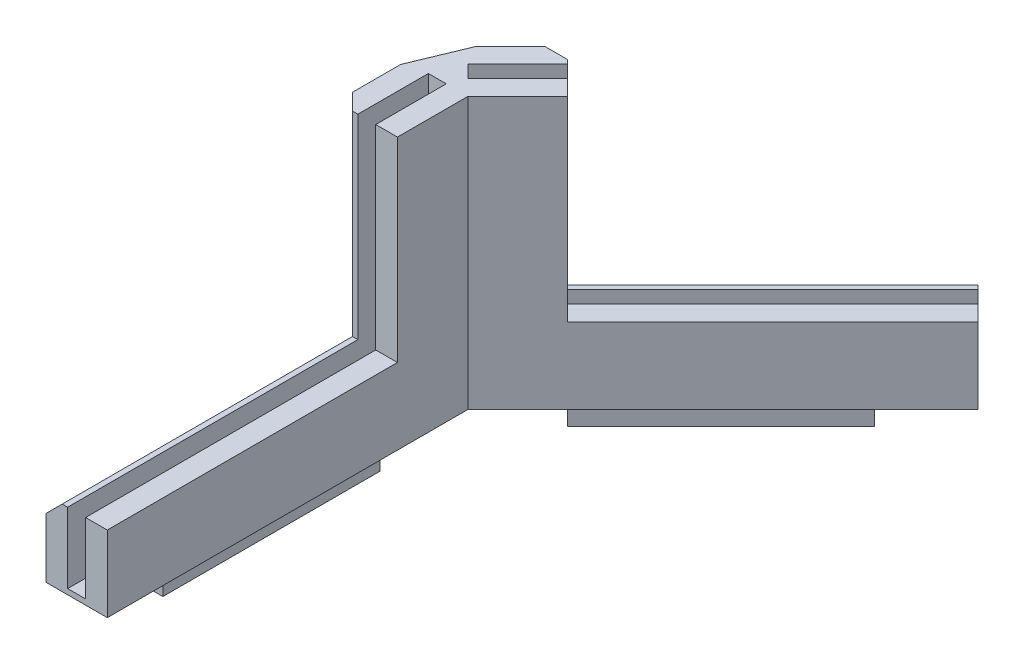
ISO-10303-21;
HEADER;
FILE_DESCRIPTION(('STEP AP214'),'2;1');
FILE_NAME('part.step','',(''),(''),'','','');
FILE_SCHEMA(('AUTOMOTIVE_DESIGN { 1 0 10303 214 1 1 1 1 }'));
ENDSEC;
DATA;
#1=APPLICATION_CONTEXT('core data for automotive mechanical design processes');
#2=APPLICATION_PROTOCOL_DEFINITION('international standard','automotive_design',2000,#1);
#3=PRODUCT_CONTEXT('',#1,'mechanical');
#4=PRODUCT('Part','Part','',(#3));
#5=PRODUCT_RELATED_PRODUCT_CATEGORY('part','',(#4));
#6=PRODUCT_DEFINITION_FORMATION('','',#4);
#7=PRODUCT_DEFINITION_CONTEXT('part definition',#1,'design');
#8=PRODUCT_DEFINITION('design','',#6,#7);
#9=PRODUCT_DEFINITION_SHAPE('','',#8);
#10=(LENGTH_UNIT() NAMED_UNIT(*) SI_UNIT(.MILLI.,.METRE.));
#11=(NAMED_UNIT(*) PLANE_ANGLE_UNIT() SI_UNIT($,.RADIAN.));
#12=(NAMED_UNIT(*) SI_UNIT($,.STERADIAN.) SOLID_ANGLE_UNIT());
#13=UNCERTAINTY_MEASURE_WITH_UNIT(LENGTH_MEASURE(1.E-05),#10,'distance_accuracy_value','');
#14=(GEOMETRIC_REPRESENTATION_CONTEXT(3) GLOBAL_UNCERTAINTY_ASSIGNED_CONTEXT((#13)) GLOBAL_UNIT_ASSIGNED_CONTEXT((#10,
#11,#12)) REPRESENTATION_CONTEXT('',''));
#15=CARTESIAN_POINT('',(0.,0.,0.));
#16=DIRECTION('',(0.,0.,1.));
#17=DIRECTION('',(1.,0.,0.));
#18=AXIS2_PLACEMENT_3D('',#15,#16,#17);
#19=CARTESIAN_POINT('',(-8.89951235406099,50.,-6.78110368347837));
#20=DIRECTION('',(0.923879869163213,0.,0.382682619614433));
#21=DIRECTION('',(0.,1.,0.));
#22=AXIS2_PLACEMENT_3D('',#19,#20,#21);
#23=PLANE('',#22);
#24=DIRECTION('',(0.,1.,0.));
#25=VECTOR('',#24,1.);
#26=CARTESIAN_POINT('',(-8.89951235406099,50.,-6.78110368347837));
#27=LINE('',#26,#25);
#28=CARTESIAN_POINT('',(-8.89951235406099,0.,-6.78110368347837));
#29=VERTEX_POINT('',#28);
#30=CARTESIAN_POINT('',(-8.89951235406099,50.,-6.78110368347837));
#31=VERTEX_POINT('',#30);
#32=EDGE_CURVE('E583',#29,#31,#27,.T.);
#33=ORIENTED_EDGE('',*,*,#32,.F.);
#34=DIRECTION('',(-0.382682619614433,0.,0.923879869163213));
#35=VECTOR('',#34,1.);
#36=CARTESIAN_POINT('',(-9.99369246144623,0.,-4.13951265572129));
#37=LINE('',#36,#35);
#38=CARTESIAN_POINT('',(-13.,0.,3.11837383565332));
#39=VERTEX_POINT('',#38);
#40=EDGE_CURVE('E591',#39,#29,#37,.F.);
#41=ORIENTED_EDGE('',*,*,#40,.F.);
#42=DIRECTION('',(0.,-1.,0.));
#43=VECTOR('',#42,1.);
#44=CARTESIAN_POINT('',(-13.,50.,3.11837383565332));
#45=LINE('',#44,#43);
#46=CARTESIAN_POINT('',(-13.,50.,3.11837383565332));
#47=VERTEX_POINT('',#46);
#48=EDGE_CURVE('E587',#47,#39,#45,.T.);
#49=ORIENTED_EDGE('',*,*,#48,.F.);
#50=DIRECTION('',(0.382682619614433,0.,-0.923879869163213));
#51=VECTOR('',#50,1.);
#52=CARTESIAN_POINT('',(-8.89951235406099,50.,-6.78110368347837));
#53=LINE('',#52,#51);
#54=EDGE_CURVE('E594',#31,#47,#53,.F.);
#55=ORIENTED_EDGE('',*,*,#54,.F.);
#56=EDGE_LOOP('',(#33,#41,#49,#55));
#57=FACE_BOUND('',#56,.T.);
#58=ADVANCED_FACE('F43',(#57),#23,.F.);
#59=CARTESIAN_POINT('',(-1.7,50.,15.));
#60=DIRECTION('',(0.,0.,-1.));
#61=DIRECTION('',(-1.,0.,0.));
#62=AXIS2_PLACEMENT_3D('',#59,#60,#61);
#63=PLANE('',#62);
#64=DIRECTION('',(1.,0.,0.));
#65=VECTOR('',#64,1.);
#66=CARTESIAN_POINT('',(-9.,50.,15.));
#67=LINE('',#66,#65);
#68=CARTESIAN_POINT('',(-9.99999999999999,50.,15.));
#69=VERTEX_POINT('',#68);
#70=CARTESIAN_POINT('',(-9.,50.,15.));
#71=VERTEX_POINT('',#70);
#72=EDGE_CURVE('E540',#69,#71,#67,.T.);
#73=ORIENTED_EDGE('',*,*,#72,.F.);
#74=DIRECTION('',(0.,-1.,0.));
#75=VECTOR('',#74,1.);
#76=CARTESIAN_POINT('',(-9.99999999999999,50.,15.));
#77=LINE('',#76,#75);
#78=CARTESIAN_POINT('',(-9.99999999999999,14.,15.));
#79=VERTEX_POINT('',#78);
#80=EDGE_CURVE('E610',#69,#79,#77,.T.);
#81=ORIENTED_EDGE('',*,*,#80,.T.);
#82=DIRECTION('',(-1.,0.,0.));
#83=VECTOR('',#82,1.);
#84=CARTESIAN_POINT('',(-13.0000000000001,14.,15.));
#85=LINE('',#84,#83);
#86=CARTESIAN_POINT('',(-9.,14.,15.));
#87=VERTEX_POINT('',#86);
#88=EDGE_CURVE('E481',#87,#79,#85,.T.);
#89=ORIENTED_EDGE('',*,*,#88,.F.);
#90=DIRECTION('',(0.,-1.,0.));
#91=VECTOR('',#90,1.);
#92=CARTESIAN_POINT('',(-9.,50.,15.));
#93=LINE('',#92,#91);
#94=EDGE_CURVE('E579',#71,#87,#93,.T.);
#95=ORIENTED_EDGE('',*,*,#94,.F.);
#96=EDGE_LOOP('',(#73,#81,#89,#95));
#97=FACE_BOUND('',#96,.T.);
#98=ADVANCED_FACE('F708',(#97),#63,.F.);
#99=DIRECTION('',(-1.,0.,0.));
#100=VECTOR('',#99,1.);
#101=CARTESIAN_POINT('',(-5.70000000000014,14.,15.));
#102=LINE('',#101,#100);
#103=CARTESIAN_POINT('',(-1.7,14.,15.));
#104=VERTEX_POINT('',#103);
#105=CARTESIAN_POINT('',(-5.70000000000014,14.,15.));
#106=VERTEX_POINT('',#105);
#107=EDGE_CURVE('E476',#104,#106,#102,.T.);
#108=ORIENTED_EDGE('',*,*,#107,.F.);
#109=DIRECTION('',(0.,-1.,0.));
#110=VECTOR('',#109,1.);
#111=CARTESIAN_POINT('',(-1.7,50.,15.));
#112=LINE('',#111,#110);
#113=CARTESIAN_POINT('',(-1.7,50.,15.));
#114=VERTEX_POINT('',#113);
#115=EDGE_CURVE('E559',#114,#104,#112,.T.);
#116=ORIENTED_EDGE('',*,*,#115,.F.);
#117=DIRECTION('',(1.,0.,0.));
#118=VECTOR('',#117,1.);
#119=CARTESIAN_POINT('',(-1.7,50.,15.));
#120=LINE('',#119,#118);
#121=CARTESIAN_POINT('',(-5.7,50.,15.));
#122=VERTEX_POINT('',#121);
#123=EDGE_CURVE('E553',#122,#114,#120,.T.);
#124=ORIENTED_EDGE('',*,*,#123,.F.);
#125=DIRECTION('',(0.,-1.,0.));
#126=VECTOR('',#125,1.);
#127=CARTESIAN_POINT('',(-5.7,50.,15.));
#128=LINE('',#127,#126);
#129=EDGE_CURVE('E568',#122,#106,#128,.T.);
#130=ORIENTED_EDGE('',*,*,#129,.T.);
#131=EDGE_LOOP('',(#108,#116,#124,#130));
#132=FACE_BOUND('',#131,.T.);
#133=ADVANCED_FACE('F747',(#132),#63,.F.);
#134=CARTESIAN_POINT('',(-9.00000000000004,50.,1.99999999999999));
#135=DIRECTION('',(-1.,0.,0.));
#136=DIRECTION('',(0.,0.,1.));
#137=AXIS2_PLACEMENT_3D('',#134,#135,#136);
#138=PLANE('',#137);
#139=DIRECTION('',(0.,0.,-1.));
#140=VECTOR('',#139,1.);
#141=CARTESIAN_POINT('',(-9.00000000000004,1.,15.));
#142=LINE('',#141,#140);
#143=CARTESIAN_POINT('',(-9.,1.,68.5));
#144=VERTEX_POINT('',#143);
#145=CARTESIAN_POINT('',(-9.00000000000004,1.,1.99999999999999));
#146=VERTEX_POINT('',#145);
#147=EDGE_CURVE('E528',#144,#146,#142,.T.);
#148=ORIENTED_EDGE('',*,*,#147,.T.);
#149=DIRECTION('',(0.,-1.,0.));
#150=VECTOR('',#149,1.);
#151=CARTESIAN_POINT('',(-9.00000000000004,50.,1.99999999999999));
#152=LINE('',#151,#150);
#153=CARTESIAN_POINT('',(-9.00000000000004,50.,1.99999999999999));
#154=VERTEX_POINT('',#153);
#155=EDGE_CURVE('E575',#154,#146,#152,.T.);
#156=ORIENTED_EDGE('',*,*,#155,.F.);
#157=DIRECTION('',(0.,0.,-1.));
#158=VECTOR('',#157,1.);
#159=CARTESIAN_POINT('',(-9.00000000000004,50.,1.99999999999999));
#160=LINE('',#159,#158);
#161=EDGE_CURVE('E544',#71,#154,#160,.T.);
#162=ORIENTED_EDGE('',*,*,#161,.F.);
#163=ORIENTED_EDGE('',*,*,#94,.T.);
#164=DIRECTION('',(0.,0.,-1.));
#165=VECTOR('',#164,1.);
#166=CARTESIAN_POINT('',(-9.00000000000013,14.,68.5));
#167=LINE('',#166,#165);
#168=CARTESIAN_POINT('',(-9.00000000000013,14.,68.5));
#169=VERTEX_POINT('',#168);
#170=EDGE_CURVE('E506',#169,#87,#167,.T.);
#171=ORIENTED_EDGE('',*,*,#170,.F.);
#172=DIRECTION('',(0.,1.,0.));
#173=VECTOR('',#172,1.);
#174=CARTESIAN_POINT('',(-9.,1.,68.5));
#175=LINE('',#174,#173);
#176=EDGE_CURVE('E499',#144,#169,#175,.T.);
#177=ORIENTED_EDGE('',*,*,#176,.F.);
#178=EDGE_LOOP('',(#148,#156,#162,#163,#171,#177));
#179=FACE_BOUND('',#178,.T.);
#180=ADVANCED_FACE('F736',(#179),#138,.F.);
#181=CARTESIAN_POINT('',(-5.7,50.,1.99999999999999));
#182=DIRECTION('',(0.,0.,-1.));
#183=DIRECTION('',(-1.,0.,0.));
#184=AXIS2_PLACEMENT_3D('',#181,#182,#183);
#185=PLANE('',#184);
#186=DIRECTION('',(-1.,0.,0.));
#187=VECTOR('',#186,1.);
#188=CARTESIAN_POINT('',(-5.7,1.,1.99999999999998));
#189=LINE('',#188,#187);
#190=CARTESIAN_POINT('',(-5.7,1.,1.99999999999999));
#191=VERTEX_POINT('',#190);
#192=EDGE_CURVE('E524',#191,#146,#189,.T.);
#193=ORIENTED_EDGE('',*,*,#192,.F.);
#194=DIRECTION('',(0.,-1.,0.));
#195=VECTOR('',#194,1.);
#196=CARTESIAN_POINT('',(-5.7,50.,1.99999999999999));
#197=LINE('',#196,#195);
#198=CARTESIAN_POINT('',(-5.7,50.,1.99999999999999));
#199=VERTEX_POINT('',#198);
#200=EDGE_CURVE('E571',#199,#191,#197,.T.);
#201=ORIENTED_EDGE('',*,*,#200,.F.);
#202=DIRECTION('',(1.,0.,0.));
#203=VECTOR('',#202,1.);
#204=CARTESIAN_POINT('',(-5.7,50.,1.99999999999999));
#205=LINE('',#204,#203);
#206=EDGE_CURVE('E547',#154,#199,#205,.T.);
#207=ORIENTED_EDGE('',*,*,#206,.F.);
#208=ORIENTED_EDGE('',*,*,#155,.T.);
#209=EDGE_LOOP('',(#193,#201,#207,#208));
#210=FACE_BOUND('',#209,.T.);
#211=ADVANCED_FACE('F740',(#210),#185,.F.);
#212=CARTESIAN_POINT('',(-5.7,50.,15.));
#213=DIRECTION('',(1.,0.,0.));
#214=DIRECTION('',(0.,0.,-1.));
#215=AXIS2_PLACEMENT_3D('',#212,#213,#214);
#216=PLANE('',#215);
#217=DIRECTION('',(0.,0.,-1.));
#218=VECTOR('',#217,1.);
#219=CARTESIAN_POINT('',(-5.7,1.,15.));
#220=LINE('',#219,#218);
#221=CARTESIAN_POINT('',(-5.7,1.,68.5));
#222=VERTEX_POINT('',#221);
#223=EDGE_CURVE('E531',#222,#191,#220,.T.);
#224=ORIENTED_EDGE('',*,*,#223,.F.);
#225=DIRECTION('',(0.,-1.,0.));
#226=VECTOR('',#225,1.);
#227=CARTESIAN_POINT('',(-5.7,1.,68.5));
#228=LINE('',#227,#226);
#229=CARTESIAN_POINT('',(-5.70000000000014,14.,68.5));
#230=VERTEX_POINT('',#229);
#231=EDGE_CURVE('E491',#230,#222,#228,.T.);
#232=ORIENTED_EDGE('',*,*,#231,.F.);
#233=DIRECTION('',(0.,0.,-1.));
#234=VECTOR('',#233,1.);
#235=CARTESIAN_POINT('',(-5.70000000000014,14.,68.5));
#236=LINE('',#235,#234);
#237=EDGE_CURVE('E516',#230,#106,#236,.T.);
#238=ORIENTED_EDGE('',*,*,#237,.T.);
#239=ORIENTED_EDGE('',*,*,#129,.F.);
#240=DIRECTION('',(0.,0.,1.));
#241=VECTOR('',#240,1.);
#242=CARTESIAN_POINT('',(-5.7,50.,15.));
#243=LINE('',#242,#241);
#244=EDGE_CURVE('E550',#199,#122,#243,.T.);
#245=ORIENTED_EDGE('',*,*,#244,.F.);
#246=ORIENTED_EDGE('',*,*,#200,.T.);
#247=EDGE_LOOP('',(#224,#232,#238,#239,#245,#246));
#248=FACE_BOUND('',#247,.T.);
#249=ADVANCED_FACE('F745',(#248),#216,.F.);
#250=CARTESIAN_POINT('',(-13.,50.,15.));
#251=DIRECTION('',(1.,0.,0.));
#252=DIRECTION('',(0.,0.,-1.));
#253=AXIS2_PLACEMENT_3D('',#250,#251,#252);
#254=PLANE('',#253);
#255=DIRECTION('',(0.,-1.,0.));
#256=VECTOR('',#255,1.);
#257=CARTESIAN_POINT('',(-13.,0.,68.5));
#258=LINE('',#257,#256);
#259=CARTESIAN_POINT('',(-13.0000000000001,11.,68.5));
#260=VERTEX_POINT('',#259);
#261=CARTESIAN_POINT('',(-13.,0.,68.5));
#262=VERTEX_POINT('',#261);
#263=EDGE_CURVE('E477',#260,#262,#258,.T.);
#264=ORIENTED_EDGE('',*,*,#263,.F.);
#265=DIRECTION('',(0.,0.,-1.));
#266=VECTOR('',#265,1.);
#267=CARTESIAN_POINT('',(-13.,11.,15.));
#268=LINE('',#267,#266);
#269=CARTESIAN_POINT('',(-13.,11.,12.));
#270=VERTEX_POINT('',#269);
#271=EDGE_CURVE('E600',#260,#270,#268,.T.);
#272=ORIENTED_EDGE('',*,*,#271,.T.);
#273=DIRECTION('',(0.,1.,0.));
#274=VECTOR('',#273,1.);
#275=CARTESIAN_POINT('',(-13.,50.,12.));
#276=LINE('',#275,#274);
#277=CARTESIAN_POINT('',(-13.,50.,12.));
#278=VERTEX_POINT('',#277);
#279=EDGE_CURVE('E597',#270,#278,#276,.T.);
#280=ORIENTED_EDGE('',*,*,#279,.T.);
#281=DIRECTION('',(0.,0.,1.));
#282=VECTOR('',#281,1.);
#283=CARTESIAN_POINT('',(-13.,50.,15.));
#284=LINE('',#283,#282);
#285=EDGE_CURVE('E536',#47,#278,#284,.T.);
#286=ORIENTED_EDGE('',*,*,#285,.F.);
#287=ORIENTED_EDGE('',*,*,#48,.T.);
#288=DIRECTION('',(0.,0.,1.));
#289=VECTOR('',#288,1.);
#290=CARTESIAN_POINT('',(-13.,0.,15.));
#291=LINE('',#290,#289);
#292=EDGE_CURVE('E535',#39,#262,#291,.T.);
#293=ORIENTED_EDGE('',*,*,#292,.T.);
#294=EDGE_LOOP('',(#264,#272,#280,#286,#287,#293));
#295=FACE_BOUND('',#294,.T.);
#296=ADVANCED_FACE('F701',(#295),#254,.F.);
#297=CARTESIAN_POINT('',(-1.7,50.,1.99999999999999));
#298=DIRECTION('',(-1.,0.,0.));
#299=DIRECTION('',(0.,0.,1.));
#300=AXIS2_PLACEMENT_3D('',#297,#298,#299);
#301=PLANE('',#300);
#302=DIRECTION('',(0.,0.,-1.));
#303=VECTOR('',#302,1.);
#304=CARTESIAN_POINT('',(-1.7,0.,1.99999999999999));
#305=LINE('',#304,#303);
#306=CARTESIAN_POINT('',(-1.7,0.,68.5));
#307=VERTEX_POINT('',#306);
#308=CARTESIAN_POINT('',(-1.7,0.,1.99999999999999));
#309=VERTEX_POINT('',#308);
#310=EDGE_CURVE('E541',#307,#309,#305,.T.);
#311=ORIENTED_EDGE('',*,*,#310,.T.);
#312=DIRECTION('',(0.,-1.,0.));
#313=VECTOR('',#312,1.);
#314=CARTESIAN_POINT('',(-1.7,50.,1.99999999999999));
#315=LINE('',#314,#313);
#316=CARTESIAN_POINT('',(-1.7,50.,1.99999999999999));
#317=VERTEX_POINT('',#316);
#318=EDGE_CURVE('E401',#317,#309,#315,.T.);
#319=ORIENTED_EDGE('',*,*,#318,.F.);
#320=DIRECTION('',(0.,0.,-1.));
#321=VECTOR('',#320,1.);
#322=CARTESIAN_POINT('',(-1.7,50.,1.99999999999999));
#323=LINE('',#322,#321);
#324=EDGE_CURVE('E556',#114,#317,#323,.T.);
#325=ORIENTED_EDGE('',*,*,#324,.F.);
#326=ORIENTED_EDGE('',*,*,#115,.T.);
#327=DIRECTION('',(0.,0.,-1.));
#328=VECTOR('',#327,1.);
#329=CARTESIAN_POINT('',(-1.70000000000015,14.,68.5));
#330=LINE('',#329,#328);
#331=CARTESIAN_POINT('',(-1.70000000000015,14.,68.5));
#332=VERTEX_POINT('',#331);
#333=EDGE_CURVE('E520',#332,#104,#330,.T.);
#334=ORIENTED_EDGE('',*,*,#333,.F.);
#335=DIRECTION('',(0.,1.,0.));
#336=VECTOR('',#335,1.);
#337=CARTESIAN_POINT('',(-1.7,0.,68.5));
#338=LINE('',#337,#336);
#339=EDGE_CURVE('E485',#307,#332,#338,.T.);
#340=ORIENTED_EDGE('',*,*,#339,.F.);
#341=EDGE_LOOP('',(#311,#319,#325,#326,#334,#340));
#342=FACE_BOUND('',#341,.T.);
#343=ADVANCED_FACE('F721',(#342),#301,.F.);
#344=CARTESIAN_POINT('',(0.,50.,0.));
#345=DIRECTION('',(0.,-1.,0.));
#346=DIRECTION('',(0.,0.,-1.));
#347=AXIS2_PLACEMENT_3D('',#344,#345,#346);
#348=PLANE('',#347);
#349=ORIENTED_EDGE('',*,*,#285,.T.);
#350=DIRECTION('',(-0.707106781186548,0.,-0.707106781186548));
#351=VECTOR('',#350,1.);
#352=CARTESIAN_POINT('',(-9.99999999999999,50.,15.));
#353=LINE('',#352,#351);
#354=EDGE_CURVE('E616',#278,#69,#353,.F.);
#355=ORIENTED_EDGE('',*,*,#354,.T.);
#356=ORIENTED_EDGE('',*,*,#72,.T.);
#357=ORIENTED_EDGE('',*,*,#161,.T.);
#358=ORIENTED_EDGE('',*,*,#206,.T.);
#359=ORIENTED_EDGE('',*,*,#244,.T.);
#360=ORIENTED_EDGE('',*,*,#123,.T.);
#361=ORIENTED_EDGE('',*,*,#324,.T.);
#362=DIRECTION('',(-0.707105537080835,0.,0.707108025290071));
#363=VECTOR('',#362,1.);
#364=CARTESIAN_POINT('',(-1.7,50.,1.99999999999999));
#365=LINE('',#364,#363);
#366=CARTESIAN_POINT('',(7.49237198205085,50.,-7.19240432877094));
#367=VERTEX_POINT('',#366);
#368=EDGE_CURVE('E397',#367,#317,#365,.T.);
#369=ORIENTED_EDGE('',*,*,#368,.F.);
#370=DIRECTION('',(0.707108025290071,0.,0.707105537080835));
#371=VECTOR('',#370,1.);
#372=CARTESIAN_POINT('',(7.49237198205085,50.,-7.19240432877094));
#373=LINE('',#372,#371);
#374=CARTESIAN_POINT('',(4.66393988089057,50.,-10.0208264770943));
#375=VERTEX_POINT('',#374);
#376=EDGE_CURVE('E393',#375,#367,#373,.T.);
#377=ORIENTED_EDGE('',*,*,#376,.F.);
#378=DIRECTION('',(0.707105537080835,0.,-0.707108025290071));
#379=VECTOR('',#378,1.);
#380=CARTESIAN_POINT('',(4.66393988089057,50.,-10.0208264770943));
#381=LINE('',#380,#379);
#382=CARTESIAN_POINT('',(-4.52843210116029,50.,-0.828422148323351));
#383=VERTEX_POINT('',#382);
#384=EDGE_CURVE('E390',#383,#375,#381,.T.);
#385=ORIENTED_EDGE('',*,*,#384,.F.);
#386=DIRECTION('',(0.707108025290071,0.,0.707105537080835));
#387=VECTOR('',#386,1.);
#388=CARTESIAN_POINT('',(-4.52843210116029,50.,-0.828422148323351));
#389=LINE('',#388,#387);
#390=CARTESIAN_POINT('',(-6.86188858461755,50.,-3.16187042069014));
#391=VERTEX_POINT('',#390);
#392=EDGE_CURVE('E386',#391,#383,#389,.T.);
#393=ORIENTED_EDGE('',*,*,#392,.F.);
#394=DIRECTION('',(-0.707105537080837,0.,0.707108025290069));
#395=VECTOR('',#394,1.);
#396=CARTESIAN_POINT('',(-6.86188858461755,50.,-3.16187042069014));
#397=LINE('',#396,#395);
#398=CARTESIAN_POINT('',(2.33048339743333,50.,-12.354274749461));
#399=VERTEX_POINT('',#398);
#400=EDGE_CURVE('E382',#399,#391,#397,.T.);
#401=ORIENTED_EDGE('',*,*,#400,.F.);
#402=DIRECTION('',(0.707108025290071,0.,0.707105537080835));
#403=VECTOR('',#402,1.);
#404=CARTESIAN_POINT('',(2.33048339743333,50.,-12.354274749461));
#405=LINE('',#404,#403);
#406=CARTESIAN_POINT('',(1.62337537214318,50.,-13.061380286542));
#407=VERTEX_POINT('',#406);
#408=EDGE_CURVE('E378',#407,#399,#405,.T.);
#409=ORIENTED_EDGE('',*,*,#408,.F.);
#410=DIRECTION('',(0.999999999998452,0.,-1.75942962369727E-06));
#411=VECTOR('',#410,1.);
#412=CARTESIAN_POINT('',(-2.61926531496937,50.,-13.0613728219142));
#413=LINE('',#412,#411);
#414=CARTESIAN_POINT('',(-2.61926531496937,50.,-13.0613728219142));
#415=VERTEX_POINT('',#414);
#416=EDGE_CURVE('E613',#407,#415,#413,.F.);
#417=ORIENTED_EDGE('',*,*,#416,.T.);
#418=DIRECTION('',(0.707105537080835,0.,-0.707108025290071));
#419=VECTOR('',#418,1.);
#420=CARTESIAN_POINT('',(-0.497948703726949,50.,-15.1826968977844));
#421=LINE('',#420,#419);
#422=EDGE_CURVE('E374',#31,#415,#421,.T.);
#423=ORIENTED_EDGE('',*,*,#422,.F.);
#424=ORIENTED_EDGE('',*,*,#54,.T.);
#425=EDGE_LOOP('',(#349,#355,#356,#357,#358,#359,#360,#361,#369,#377,#385,#393,#401,#409,#417,
#423,#424));
#426=FACE_BOUND('',#425,.T.);
#427=ADVANCED_FACE('F651',(#426),#348,.F.);
#428=CARTESIAN_POINT('',(0.,0.,0.));
#429=DIRECTION('',(0.,-1.,0.));
#430=DIRECTION('',(0.,0.,-1.));
#431=AXIS2_PLACEMENT_3D('',#428,#429,#430);
#432=PLANE('',#431);
#433=DIRECTION('',(0.,0.,-1.));
#434=VECTOR('',#433,1.);
#435=CARTESIAN_POINT('',(-9.75,0.,55.));
#436=LINE('',#435,#434);
#437=CARTESIAN_POINT('',(-9.75,0.,55.));
#438=VERTEX_POINT('',#437);
#439=CARTESIAN_POINT('',(-9.75,0.,15.));
#440=VERTEX_POINT('',#439);
#441=EDGE_CURVE('E431',#438,#440,#436,.T.);
#442=ORIENTED_EDGE('',*,*,#441,.F.);
#443=DIRECTION('',(-1.,0.,0.));
#444=VECTOR('',#443,1.);
#445=CARTESIAN_POINT('',(-4.95,0.,55.));
#446=LINE('',#445,#444);
#447=CARTESIAN_POINT('',(-4.95,0.,55.));
#448=VERTEX_POINT('',#447);
#449=EDGE_CURVE('E437',#448,#438,#446,.T.);
#450=ORIENTED_EDGE('',*,*,#449,.F.);
#451=DIRECTION('',(0.,0.,1.));
#452=VECTOR('',#451,1.);
#453=CARTESIAN_POINT('',(-4.95,0.,55.));
#454=LINE('',#453,#452);
#455=CARTESIAN_POINT('',(-4.95,0.,15.));
#456=VERTEX_POINT('',#455);
#457=EDGE_CURVE('E454',#456,#448,#454,.T.);
#458=ORIENTED_EDGE('',*,*,#457,.F.);
#459=DIRECTION('',(1.,0.,0.));
#460=VECTOR('',#459,1.);
#461=CARTESIAN_POINT('',(-4.95,0.,15.));
#462=LINE('',#461,#460);
#463=EDGE_CURVE('E450',#440,#456,#462,.T.);
#464=ORIENTED_EDGE('',*,*,#463,.F.);
#465=EDGE_LOOP('',(#442,#450,#458,#464));
#466=FACE_BOUND('',#465,.T.);
#467=ORIENTED_EDGE('',*,*,#292,.F.);
#468=ORIENTED_EDGE('',*,*,#40,.T.);
#469=DIRECTION('',(0.707105537080835,0.,-0.707108025290071));
#470=VECTOR('',#469,1.);
#471=CARTESIAN_POINT('',(-0.497948703726949,0.,-15.1826968977844));
#472=LINE('',#471,#470);
#473=CARTESIAN_POINT('',(37.3321975300977,0.,-53.0129762508032));
#474=VERTEX_POINT('',#473);
#475=EDGE_CURVE('E373',#29,#474,#472,.T.);
#476=ORIENTED_EDGE('',*,*,#475,.T.);
#477=DIRECTION('',(0.707108025290071,0.,0.707105537080835));
#478=VECTOR('',#477,1.);
#479=CARTESIAN_POINT('',(37.3321975300977,0.,-53.0129762508032));
#480=LINE('',#479,#478);
#481=CARTESIAN_POINT('',(45.3225182158755,0.,-45.0226836817897));
#482=VERTEX_POINT('',#481);
#483=EDGE_CURVE('E324',#474,#482,#480,.T.);
#484=ORIENTED_EDGE('',*,*,#483,.T.);
#485=DIRECTION('',(-0.707105537080835,0.,0.707108025290071));
#486=VECTOR('',#485,1.);
#487=CARTESIAN_POINT('',(-1.7,0.,1.99999999999999));
#488=LINE('',#487,#486);
#489=EDGE_CURVE('E379',#482,#309,#488,.T.);
#490=ORIENTED_EDGE('',*,*,#489,.T.);
#491=ORIENTED_EDGE('',*,*,#310,.F.);
#492=DIRECTION('',(1.,0.,0.));
#493=VECTOR('',#492,1.);
#494=CARTESIAN_POINT('',(-13.,0.,68.5));
#495=LINE('',#494,#493);
#496=EDGE_CURVE('E480',#262,#307,#495,.T.);
#497=ORIENTED_EDGE('',*,*,#496,.F.);
#498=EDGE_LOOP('',(#467,#468,#476,#484,#490,#491,#497));
#499=FACE_BOUND('',#498,.T.);
#500=DIRECTION('',(-0.707105537080835,0.,0.707108025290071));
#501=VECTOR('',#500,1.);
#502=CARTESIAN_POINT('',(30.0843738616992,0.,-41.1689249138745));
#503=LINE('',#502,#501);
#504=CARTESIAN_POINT('',(30.0843738616992,0.,-41.1689249138745));
#505=VERTEX_POINT('',#504);
#506=CARTESIAN_POINT('',(1.80015237846578,0.,-12.8846039022717));
#507=VERTEX_POINT('',#506);
#508=EDGE_CURVE('E305',#505,#507,#503,.T.);
#509=ORIENTED_EDGE('',*,*,#508,.T.);
#510=DIRECTION('',(0.707108025290071,0.,0.707105537080835));
#511=VECTOR('',#510,1.);
#512=CARTESIAN_POINT('',(5.19427089985812,0.,-9.49049732428365));
#513=LINE('',#512,#511);
#514=CARTESIAN_POINT('',(5.19427089985812,0.,-9.49049732428365));
#515=VERTEX_POINT('',#514);
#516=EDGE_CURVE('E282',#507,#515,#513,.T.);
#517=ORIENTED_EDGE('',*,*,#516,.T.);
#518=DIRECTION('',(0.707105537080835,0.,-0.707108025290071));
#519=VECTOR('',#518,1.);
#520=CARTESIAN_POINT('',(33.4784923830915,0.,-37.7748183358865));
#521=LINE('',#520,#519);
#522=CARTESIAN_POINT('',(33.4784923830915,0.,-37.7748183358865));
#523=VERTEX_POINT('',#522);
#524=EDGE_CURVE('E297',#515,#523,#521,.T.);
#525=ORIENTED_EDGE('',*,*,#524,.T.);
#526=DIRECTION('',(-0.707108025290071,0.,-0.707105537080835));
#527=VECTOR('',#526,1.);
#528=CARTESIAN_POINT('',(33.4784923830915,0.,-37.7748183358865));
#529=LINE('',#528,#527);
#530=EDGE_CURVE('E293',#523,#505,#529,.T.);
#531=ORIENTED_EDGE('',*,*,#530,.T.);
#532=EDGE_LOOP('',(#509,#517,#525,#531));
#533=FACE_BOUND('',#532,.T.);
#534=ADVANCED_FACE('F694',(#466,#499,#533),#432,.T.);
#535=CARTESIAN_POINT('',(-5.7,1.,15.));
#536=DIRECTION('',(0.,-1.,0.));
#537=DIRECTION('',(0.,0.,-1.));
#538=AXIS2_PLACEMENT_3D('',#535,#536,#537);
#539=PLANE('',#538);
#540=ORIENTED_EDGE('',*,*,#192,.T.);
#541=ORIENTED_EDGE('',*,*,#147,.F.);
#542=DIRECTION('',(-1.,0.,0.));
#543=VECTOR('',#542,1.);
#544=CARTESIAN_POINT('',(-9.,1.,68.5));
#545=LINE('',#544,#543);
#546=EDGE_CURVE('E495',#222,#144,#545,.T.);
#547=ORIENTED_EDGE('',*,*,#546,.F.);
#548=ORIENTED_EDGE('',*,*,#223,.T.);
#549=EDGE_LOOP('',(#540,#541,#547,#548));
#550=FACE_BOUND('',#549,.T.);
#551=ADVANCED_FACE('F733',(#550),#539,.F.);
#552=CARTESIAN_POINT('',(-5.70000000000014,14.,68.5));
#553=DIRECTION('',(0.,-1.,0.));
#554=DIRECTION('',(0.,0.,-1.));
#555=AXIS2_PLACEMENT_3D('',#552,#553,#554);
#556=PLANE('',#555);
#557=ORIENTED_EDGE('',*,*,#107,.T.);
#558=ORIENTED_EDGE('',*,*,#237,.F.);
#559=DIRECTION('',(-1.,0.,0.));
#560=VECTOR('',#559,1.);
#561=CARTESIAN_POINT('',(-5.70000000000014,14.,68.5));
#562=LINE('',#561,#560);
#563=EDGE_CURVE('E488',#332,#230,#562,.T.);
#564=ORIENTED_EDGE('',*,*,#563,.F.);
#565=ORIENTED_EDGE('',*,*,#333,.T.);
#566=EDGE_LOOP('',(#557,#558,#564,#565));
#567=FACE_BOUND('',#566,.T.);
#568=ADVANCED_FACE('F727',(#567),#556,.F.);
#569=CARTESIAN_POINT('',(-13.0000000000001,14.,68.5));
#570=DIRECTION('',(0.,-1.,0.));
#571=DIRECTION('',(0.,0.,-1.));
#572=AXIS2_PLACEMENT_3D('',#569,#570,#571);
#573=PLANE('',#572);
#574=ORIENTED_EDGE('',*,*,#88,.T.);
#575=DIRECTION('',(0.,0.,1.));
#576=VECTOR('',#575,1.);
#577=CARTESIAN_POINT('',(-9.99999999999999,14.,68.5));
#578=LINE('',#577,#576);
#579=CARTESIAN_POINT('',(-9.99999999999999,14.,68.5));
#580=VERTEX_POINT('',#579);
#581=EDGE_CURVE('E604',#79,#580,#578,.T.);
#582=ORIENTED_EDGE('',*,*,#581,.T.);
#583=DIRECTION('',(-1.,0.,0.));
#584=VECTOR('',#583,1.);
#585=CARTESIAN_POINT('',(-13.0000000000001,14.,68.5));
#586=LINE('',#585,#584);
#587=EDGE_CURVE('E502',#169,#580,#586,.T.);
#588=ORIENTED_EDGE('',*,*,#587,.F.);
#589=ORIENTED_EDGE('',*,*,#170,.T.);
#590=EDGE_LOOP('',(#574,#582,#588,#589));
#591=FACE_BOUND('',#590,.T.);
#592=ADVANCED_FACE('F711',(#591),#573,.F.);
#593=CARTESIAN_POINT('',(0.,0.,68.5));
#594=DIRECTION('',(0.,0.,-1.));
#595=DIRECTION('',(-1.,0.,0.));
#596=AXIS2_PLACEMENT_3D('',#593,#594,#595);
#597=PLANE('',#596);
#598=ORIENTED_EDGE('',*,*,#587,.T.);
#599=DIRECTION('',(0.707106781186547,0.707106781186548,0.));
#600=VECTOR('',#599,1.);
#601=CARTESIAN_POINT('',(-13.,11.,68.5));
#602=LINE('',#601,#600);
#603=EDGE_CURVE('E607',#580,#260,#602,.F.);
#604=ORIENTED_EDGE('',*,*,#603,.T.);
#605=ORIENTED_EDGE('',*,*,#263,.T.);
#606=ORIENTED_EDGE('',*,*,#496,.T.);
#607=ORIENTED_EDGE('',*,*,#339,.T.);
#608=ORIENTED_EDGE('',*,*,#563,.T.);
#609=ORIENTED_EDGE('',*,*,#231,.T.);
#610=ORIENTED_EDGE('',*,*,#546,.T.);
#611=ORIENTED_EDGE('',*,*,#176,.T.);
#612=EDGE_LOOP('',(#598,#604,#605,#606,#607,#608,#609,#610,#611));
#613=FACE_BOUND('',#612,.T.);
#614=ADVANCED_FACE('F717',(#613),#597,.F.);
#615=CARTESIAN_POINT('',(-9.75,-5.,55.));
#616=DIRECTION('',(1.,0.,0.));
#617=DIRECTION('',(0.,0.,-1.));
#618=AXIS2_PLACEMENT_3D('',#615,#616,#617);
#619=PLANE('',#618);
#620=ORIENTED_EDGE('',*,*,#441,.T.);
#621=DIRECTION('',(0.,1.,0.));
#622=VECTOR('',#621,1.);
#623=CARTESIAN_POINT('',(-9.75,-5.,15.));
#624=LINE('',#623,#622);
#625=CARTESIAN_POINT('',(-9.75,-5.,15.));
#626=VERTEX_POINT('',#625);
#627=EDGE_CURVE('E472',#626,#440,#624,.T.);
#628=ORIENTED_EDGE('',*,*,#627,.F.);
#629=DIRECTION('',(0.,0.,-1.));
#630=VECTOR('',#629,1.);
#631=CARTESIAN_POINT('',(-9.75,-5.,55.));
#632=LINE('',#631,#630);
#633=CARTESIAN_POINT('',(-9.75,-5.,55.));
#634=VERTEX_POINT('',#633);
#635=EDGE_CURVE('E432',#634,#626,#632,.T.);
#636=ORIENTED_EDGE('',*,*,#635,.F.);
#637=DIRECTION('',(0.,1.,0.));
#638=VECTOR('',#637,1.);
#639=CARTESIAN_POINT('',(-9.75,-5.,55.));
#640=LINE('',#639,#638);
#641=EDGE_CURVE('E446',#634,#438,#640,.T.);
#642=ORIENTED_EDGE('',*,*,#641,.T.);
#643=EDGE_LOOP('',(#620,#628,#636,#642));
#644=FACE_BOUND('',#643,.T.);
#645=ADVANCED_FACE('F916',(#644),#619,.F.);
#646=CARTESIAN_POINT('',(-4.95,-5.,15.));
#647=DIRECTION('',(0.,0.,1.));
#648=DIRECTION('',(1.,0.,0.));
#649=AXIS2_PLACEMENT_3D('',#646,#647,#648);
#650=PLANE('',#649);
#651=ORIENTED_EDGE('',*,*,#463,.T.);
#652=DIRECTION('',(0.,1.,0.));
#653=VECTOR('',#652,1.);
#654=CARTESIAN_POINT('',(-4.95,-5.,15.));
#655=LINE('',#654,#653);
#656=CARTESIAN_POINT('',(-4.95,-5.,15.));
#657=VERTEX_POINT('',#656);
#658=EDGE_CURVE('E468',#657,#456,#655,.T.);
#659=ORIENTED_EDGE('',*,*,#658,.F.);
#660=DIRECTION('',(1.,0.,0.));
#661=VECTOR('',#660,1.);
#662=CARTESIAN_POINT('',(-4.95,-5.,15.));
#663=LINE('',#662,#661);
#664=EDGE_CURVE('E436',#626,#657,#663,.T.);
#665=ORIENTED_EDGE('',*,*,#664,.F.);
#666=ORIENTED_EDGE('',*,*,#627,.T.);
#667=EDGE_LOOP('',(#651,#659,#665,#666));
#668=FACE_BOUND('',#667,.T.);
#669=ADVANCED_FACE('F907',(#668),#650,.F.);
#670=CARTESIAN_POINT('',(-4.95,-5.,55.));
#671=DIRECTION('',(-1.,0.,0.));
#672=DIRECTION('',(0.,0.,1.));
#673=AXIS2_PLACEMENT_3D('',#670,#671,#672);
#674=PLANE('',#673);
#675=ORIENTED_EDGE('',*,*,#457,.T.);
#676=DIRECTION('',(0.,1.,0.));
#677=VECTOR('',#676,1.);
#678=CARTESIAN_POINT('',(-4.95,-5.,55.));
#679=LINE('',#678,#677);
#680=CARTESIAN_POINT('',(-4.95,-5.,55.));
#681=VERTEX_POINT('',#680);
#682=EDGE_CURVE('E464',#681,#448,#679,.T.);
#683=ORIENTED_EDGE('',*,*,#682,.F.);
#684=DIRECTION('',(0.,0.,1.));
#685=VECTOR('',#684,1.);
#686=CARTESIAN_POINT('',(-4.95,-5.,55.));
#687=LINE('',#686,#685);
#688=EDGE_CURVE('E440',#657,#681,#687,.T.);
#689=ORIENTED_EDGE('',*,*,#688,.F.);
#690=ORIENTED_EDGE('',*,*,#658,.T.);
#691=EDGE_LOOP('',(#675,#683,#689,#690));
#692=FACE_BOUND('',#691,.T.);
#693=ADVANCED_FACE('F898',(#692),#674,.F.);
#694=CARTESIAN_POINT('',(-4.95,-5.,55.));
#695=DIRECTION('',(0.,0.,-1.));
#696=DIRECTION('',(-1.,0.,0.));
#697=AXIS2_PLACEMENT_3D('',#694,#695,#696);
#698=PLANE('',#697);
#699=ORIENTED_EDGE('',*,*,#449,.T.);
#700=ORIENTED_EDGE('',*,*,#641,.F.);
#701=DIRECTION('',(-1.,0.,0.));
#702=VECTOR('',#701,1.);
#703=CARTESIAN_POINT('',(-4.95,-5.,55.));
#704=LINE('',#703,#702);
#705=EDGE_CURVE('E443',#681,#634,#704,.T.);
#706=ORIENTED_EDGE('',*,*,#705,.F.);
#707=ORIENTED_EDGE('',*,*,#682,.T.);
#708=EDGE_LOOP('',(#699,#700,#706,#707));
#709=FACE_BOUND('',#708,.T.);
#710=ADVANCED_FACE('F888',(#709),#698,.F.);
#711=CARTESIAN_POINT('',(0.,-5.,0.));
#712=DIRECTION('',(0.,1.,0.));
#713=DIRECTION('',(0.,0.,1.));
#714=AXIS2_PLACEMENT_3D('',#711,#712,#713);
#715=PLANE('',#714);
#716=ORIENTED_EDGE('',*,*,#635,.T.);
#717=ORIENTED_EDGE('',*,*,#664,.T.);
#718=ORIENTED_EDGE('',*,*,#688,.T.);
#719=ORIENTED_EDGE('',*,*,#705,.T.);
#720=EDGE_LOOP('',(#716,#717,#718,#719));
#721=FACE_BOUND('',#720,.T.);
#722=ADVANCED_FACE('F881',(#721),#715,.F.);
#723=CARTESIAN_POINT('',(7.49237198205085,50.,-7.19240432877094));
#724=DIRECTION('',(-0.707105537080835,0.,0.707108025290071));
#725=DIRECTION('',(-0.707108025290071,0.,-0.707105537080835));
#726=AXIS2_PLACEMENT_3D('',#723,#724,#725);
#727=PLANE('',#726);
#728=DIRECTION('',(-0.707108025290071,0.,-0.707105537080835));
#729=VECTOR('',#728,1.);
#730=CARTESIAN_POINT('',(-0.497948703727053,14.,-15.1826968977845));
#731=LINE('',#730,#729);
#732=CARTESIAN_POINT('',(2.33048339743333,14.,-12.354274749461));
#733=VERTEX_POINT('',#732);
#734=CARTESIAN_POINT('',(1.62337537214318,14.,-13.061380286542));
#735=VERTEX_POINT('',#734);
#736=EDGE_CURVE('E325',#733,#735,#731,.T.);
#737=ORIENTED_EDGE('',*,*,#736,.T.);
#738=DIRECTION('',(0.,1.,0.));
#739=VECTOR('',#738,1.);
#740=CARTESIAN_POINT('',(1.62337537214317,50.,-13.061380286542));
#741=LINE('',#740,#739);
#742=EDGE_CURVE('E626',#735,#407,#741,.T.);
#743=ORIENTED_EDGE('',*,*,#742,.T.);
#744=ORIENTED_EDGE('',*,*,#408,.T.);
#745=DIRECTION('',(0.,-1.,0.));
#746=VECTOR('',#745,1.);
#747=CARTESIAN_POINT('',(2.33048339743333,50.,-12.354274749461));
#748=LINE('',#747,#746);
#749=EDGE_CURVE('E427',#399,#733,#748,.T.);
#750=ORIENTED_EDGE('',*,*,#749,.T.);
#751=EDGE_LOOP('',(#737,#743,#744,#750));
#752=FACE_BOUND('',#751,.T.);
#753=ADVANCED_FACE('F657',(#752),#727,.F.);
#754=DIRECTION('',(-0.707108025290071,0.,-0.707105537080835));
#755=VECTOR('',#754,1.);
#756=CARTESIAN_POINT('',(4.66393988089047,14.,-10.0208264770944));
#757=LINE('',#756,#755);
#758=CARTESIAN_POINT('',(7.49237198205085,14.,-7.19240432877094));
#759=VERTEX_POINT('',#758);
#760=CARTESIAN_POINT('',(4.66393988089047,14.,-10.0208264770944));
#761=VERTEX_POINT('',#760);
#762=EDGE_CURVE('E287',#759,#761,#757,.T.);
#763=ORIENTED_EDGE('',*,*,#762,.T.);
#764=DIRECTION('',(0.,-1.,0.));
#765=VECTOR('',#764,1.);
#766=CARTESIAN_POINT('',(4.66393988089057,50.,-10.0208264770943));
#767=LINE('',#766,#765);
#768=EDGE_CURVE('E415',#375,#761,#767,.T.);
#769=ORIENTED_EDGE('',*,*,#768,.F.);
#770=ORIENTED_EDGE('',*,*,#376,.T.);
#771=DIRECTION('',(0.,-1.,0.));
#772=VECTOR('',#771,1.);
#773=CARTESIAN_POINT('',(7.49237198205085,50.,-7.19240432877094));
#774=LINE('',#773,#772);
#775=EDGE_CURVE('E411',#367,#759,#774,.T.);
#776=ORIENTED_EDGE('',*,*,#775,.T.);
#777=EDGE_LOOP('',(#763,#769,#770,#776));
#778=FACE_BOUND('',#777,.T.);
#779=ADVANCED_FACE('F681',(#778),#727,.F.);
#780=CARTESIAN_POINT('',(-6.86188858461755,50.,-3.16187042069014));
#781=DIRECTION('',(-0.707108025290068,0.,-0.707105537080838));
#782=DIRECTION('',(0.707105537080837,0.,-0.707108025290069));
#783=AXIS2_PLACEMENT_3D('',#780,#781,#782);
#784=PLANE('',#783);
#785=DIRECTION('',(-0.707105537080835,0.,0.707108025290071));
#786=VECTOR('',#785,1.);
#787=CARTESIAN_POINT('',(2.3304833974333,1.,-12.3542747494611));
#788=LINE('',#787,#786);
#789=CARTESIAN_POINT('',(40.160629631258,1.,-50.1845541024798));
#790=VERTEX_POINT('',#789);
#791=CARTESIAN_POINT('',(-6.86188858461755,1.,-3.16187042069014));
#792=VERTEX_POINT('',#791);
#793=EDGE_CURVE('E366',#790,#792,#788,.T.);
#794=ORIENTED_EDGE('',*,*,#793,.F.);
#795=DIRECTION('',(0.,1.,0.));
#796=VECTOR('',#795,1.);
#797=CARTESIAN_POINT('',(40.160629631258,1.,-50.1845541024798));
#798=LINE('',#797,#796);
#799=CARTESIAN_POINT('',(40.1606296312579,14.,-50.1845541024799));
#800=VERTEX_POINT('',#799);
#801=EDGE_CURVE('E342',#790,#800,#798,.T.);
#802=ORIENTED_EDGE('',*,*,#801,.T.);
#803=DIRECTION('',(-0.707105537080835,0.,0.707108025290071));
#804=VECTOR('',#803,1.);
#805=CARTESIAN_POINT('',(40.1606296312579,14.,-50.1845541024799));
#806=LINE('',#805,#804);
#807=EDGE_CURVE('E349',#800,#733,#806,.T.);
#808=ORIENTED_EDGE('',*,*,#807,.T.);
#809=ORIENTED_EDGE('',*,*,#749,.F.);
#810=ORIENTED_EDGE('',*,*,#400,.T.);
#811=DIRECTION('',(0.,-1.,0.));
#812=VECTOR('',#811,1.);
#813=CARTESIAN_POINT('',(-6.86188858461755,50.,-3.16187042069014));
#814=LINE('',#813,#812);
#815=EDGE_CURVE('E423',#391,#792,#814,.T.);
#816=ORIENTED_EDGE('',*,*,#815,.T.);
#817=EDGE_LOOP('',(#794,#802,#808,#809,#810,#816));
#818=FACE_BOUND('',#817,.T.);
#819=ADVANCED_FACE('F663',(#818),#784,.F.);
#820=CARTESIAN_POINT('',(-4.52843210116029,50.,-0.828422148323351));
#821=DIRECTION('',(-0.707105537080835,0.,0.707108025290071));
#822=DIRECTION('',(-0.707108025290071,0.,-0.707105537080835));
#823=AXIS2_PLACEMENT_3D('',#820,#821,#822);
#824=PLANE('',#823);
#825=DIRECTION('',(-0.707108025290071,0.,-0.707105537080835));
#826=VECTOR('',#825,1.);
#827=CARTESIAN_POINT('',(-4.52843210116029,1.,-0.828422148323351));
#828=LINE('',#827,#826);
#829=CARTESIAN_POINT('',(-4.52843210116029,1.,-0.828422148323351));
#830=VERTEX_POINT('',#829);
#831=EDGE_CURVE('E363',#830,#792,#828,.T.);
#832=ORIENTED_EDGE('',*,*,#831,.T.);
#833=ORIENTED_EDGE('',*,*,#815,.F.);
#834=ORIENTED_EDGE('',*,*,#392,.T.);
#835=DIRECTION('',(0.,-1.,0.));
#836=VECTOR('',#835,1.);
#837=CARTESIAN_POINT('',(-4.52843210116029,50.,-0.828422148323351));
#838=LINE('',#837,#836);
#839=EDGE_CURVE('E419',#383,#830,#838,.T.);
#840=ORIENTED_EDGE('',*,*,#839,.T.);
#841=EDGE_LOOP('',(#832,#833,#834,#840));
#842=FACE_BOUND('',#841,.T.);
#843=ADVANCED_FACE('F676',(#842),#824,.F.);
#844=CARTESIAN_POINT('',(4.66393988089057,50.,-10.0208264770943));
#845=DIRECTION('',(0.707108025290071,0.,0.707105537080835));
#846=DIRECTION('',(-0.707105537080835,0.,0.707108025290071));
#847=AXIS2_PLACEMENT_3D('',#844,#845,#846);
#848=PLANE('',#847);
#849=DIRECTION('',(-0.707105537080835,0.,0.707108025290071));
#850=VECTOR('',#849,1.);
#851=CARTESIAN_POINT('',(4.66393988089057,1.,-10.0208264770943));
#852=LINE('',#851,#850);
#853=CARTESIAN_POINT('',(42.4940861147152,1.,-47.8511058301131));
#854=VERTEX_POINT('',#853);
#855=EDGE_CURVE('E370',#854,#830,#852,.T.);
#856=ORIENTED_EDGE('',*,*,#855,.T.);
#857=ORIENTED_EDGE('',*,*,#839,.F.);
#858=ORIENTED_EDGE('',*,*,#384,.T.);
#859=ORIENTED_EDGE('',*,*,#768,.T.);
#860=DIRECTION('',(-0.707105537080835,0.,0.707108025290071));
#861=VECTOR('',#860,1.);
#862=CARTESIAN_POINT('',(42.4940861147151,14.,-47.8511058301132));
#863=LINE('',#862,#861);
#864=CARTESIAN_POINT('',(42.4940861147151,14.,-47.8511058301132));
#865=VERTEX_POINT('',#864);
#866=EDGE_CURVE('E357',#865,#761,#863,.T.);
#867=ORIENTED_EDGE('',*,*,#866,.F.);
#868=DIRECTION('',(0.,-1.,0.));
#869=VECTOR('',#868,1.);
#870=CARTESIAN_POINT('',(42.4940861147152,1.,-47.8511058301131));
#871=LINE('',#870,#869);
#872=EDGE_CURVE('E335',#865,#854,#871,.T.);
#873=ORIENTED_EDGE('',*,*,#872,.T.);
#874=EDGE_LOOP('',(#856,#857,#858,#859,#867,#873));
#875=FACE_BOUND('',#874,.T.);
#876=ADVANCED_FACE('F670',(#875),#848,.F.);
#877=CARTESIAN_POINT('',(-0.497948703726949,50.,-15.1826968977844));
#878=DIRECTION('',(0.707108025290071,0.,0.707105537080835));
#879=DIRECTION('',(-0.707105537080835,0.,0.707108025290071));
#880=AXIS2_PLACEMENT_3D('',#877,#878,#879);
#881=PLANE('',#880);
#882=ORIENTED_EDGE('',*,*,#422,.T.);
#883=DIRECTION('',(0.,-1.,0.));
#884=VECTOR('',#883,1.);
#885=CARTESIAN_POINT('',(-2.61926531496937,50.,-13.0613728219142));
#886=LINE('',#885,#884);
#887=CARTESIAN_POINT('',(-2.61926531496937,11.0000000000001,-13.0613728219142));
#888=VERTEX_POINT('',#887);
#889=EDGE_CURVE('E622',#415,#888,#886,.T.);
#890=ORIENTED_EDGE('',*,*,#889,.T.);
#891=DIRECTION('',(0.707105537080835,0.,-0.707108025290071));
#892=VECTOR('',#891,1.);
#893=CARTESIAN_POINT('',(-0.497948703726949,11.0000000000001,-15.1826968977844));
#894=LINE('',#893,#892);
#895=CARTESIAN_POINT('',(37.3321975300976,11.0000000000001,-53.0129762508033));
#896=VERTEX_POINT('',#895);
#897=EDGE_CURVE('E619',#888,#896,#894,.T.);
#898=ORIENTED_EDGE('',*,*,#897,.T.);
#899=DIRECTION('',(0.,-1.,0.));
#900=VECTOR('',#899,1.);
#901=CARTESIAN_POINT('',(37.3321975300977,0.,-53.0129762508032));
#902=LINE('',#901,#900);
#903=EDGE_CURVE('E321',#896,#474,#902,.T.);
#904=ORIENTED_EDGE('',*,*,#903,.T.);
#905=ORIENTED_EDGE('',*,*,#475,.F.);
#906=ORIENTED_EDGE('',*,*,#32,.T.);
#907=EDGE_LOOP('',(#882,#890,#898,#904,#905,#906));
#908=FACE_BOUND('',#907,.T.);
#909=ADVANCED_FACE('F646',(#908),#881,.F.);
#910=CARTESIAN_POINT('',(-1.7,50.,1.99999999999999));
#911=DIRECTION('',(-0.707108025290071,0.,-0.707105537080835));
#912=DIRECTION('',(0.707105537080835,0.,-0.707108025290071));
#913=AXIS2_PLACEMENT_3D('',#910,#911,#912);
#914=PLANE('',#913);
#915=ORIENTED_EDGE('',*,*,#489,.F.);
#916=DIRECTION('',(0.,1.,0.));
#917=VECTOR('',#916,1.);
#918=CARTESIAN_POINT('',(45.3225182158755,0.,-45.0226836817897));
#919=LINE('',#918,#917);
#920=CARTESIAN_POINT('',(45.3225182158754,14.,-45.0226836817898));
#921=VERTEX_POINT('',#920);
#922=EDGE_CURVE('E328',#482,#921,#919,.T.);
#923=ORIENTED_EDGE('',*,*,#922,.T.);
#924=DIRECTION('',(-0.707105537080835,0.,0.707108025290071));
#925=VECTOR('',#924,1.);
#926=CARTESIAN_POINT('',(45.3225182158754,14.,-45.0226836817898));
#927=LINE('',#926,#925);
#928=EDGE_CURVE('E360',#921,#759,#927,.T.);
#929=ORIENTED_EDGE('',*,*,#928,.T.);
#930=ORIENTED_EDGE('',*,*,#775,.F.);
#931=ORIENTED_EDGE('',*,*,#368,.T.);
#932=ORIENTED_EDGE('',*,*,#318,.T.);
#933=EDGE_LOOP('',(#915,#923,#929,#930,#931,#932));
#934=FACE_BOUND('',#933,.T.);
#935=ADVANCED_FACE('F690',(#934),#914,.F.);
#936=CARTESIAN_POINT('',(4.66393988089057,1.,-10.0208264770943));
#937=DIRECTION('',(0.,-1.,0.));
#938=DIRECTION('',(-0.707105537080835,0.,0.707108025290071));
#939=AXIS2_PLACEMENT_3D('',#936,#937,#938);
#940=PLANE('',#939);
#941=ORIENTED_EDGE('',*,*,#831,.F.);
#942=ORIENTED_EDGE('',*,*,#855,.F.);
#943=DIRECTION('',(-0.707108025290071,0.,-0.707105537080835));
#944=VECTOR('',#943,1.);
#945=CARTESIAN_POINT('',(40.160629631258,1.,-50.1845541024798));
#946=LINE('',#945,#944);
#947=EDGE_CURVE('E339',#854,#790,#946,.T.);
#948=ORIENTED_EDGE('',*,*,#947,.T.);
#949=ORIENTED_EDGE('',*,*,#793,.T.);
#950=EDGE_LOOP('',(#941,#942,#948,#949));
#951=FACE_BOUND('',#950,.T.);
#952=ADVANCED_FACE('F673',(#951),#940,.F.);
#953=CARTESIAN_POINT('',(42.4940861147151,14.,-47.8511058301132));
#954=DIRECTION('',(0.,-1.,0.));
#955=DIRECTION('',(-0.707105537080835,0.,0.707108025290071));
#956=AXIS2_PLACEMENT_3D('',#953,#954,#955);
#957=PLANE('',#956);
#958=ORIENTED_EDGE('',*,*,#762,.F.);
#959=ORIENTED_EDGE('',*,*,#928,.F.);
#960=DIRECTION('',(-0.707108025290071,0.,-0.707105537080835));
#961=VECTOR('',#960,1.);
#962=CARTESIAN_POINT('',(42.4940861147151,14.,-47.8511058301132));
#963=LINE('',#962,#961);
#964=EDGE_CURVE('E332',#921,#865,#963,.T.);
#965=ORIENTED_EDGE('',*,*,#964,.T.);
#966=ORIENTED_EDGE('',*,*,#866,.T.);
#967=EDGE_LOOP('',(#958,#959,#965,#966));
#968=FACE_BOUND('',#967,.T.);
#969=ADVANCED_FACE('F685',(#968),#957,.F.);
#970=CARTESIAN_POINT('',(37.3321975300976,14.,-53.0129762508033));
#971=DIRECTION('',(0.,-1.,0.));
#972=DIRECTION('',(-0.707105537080835,0.,0.707108025290071));
#973=AXIS2_PLACEMENT_3D('',#970,#971,#972);
#974=PLANE('',#973);
#975=DIRECTION('',(-0.707108025290071,0.,-0.707105537080835));
#976=VECTOR('',#975,1.);
#977=CARTESIAN_POINT('',(37.3321975300976,14.,-53.0129762508033));
#978=LINE('',#977,#976);
#979=CARTESIAN_POINT('',(39.4535216059679,14.,-50.8916596395607));
#980=VERTEX_POINT('',#979);
#981=EDGE_CURVE('E346',#800,#980,#978,.T.);
#982=ORIENTED_EDGE('',*,*,#981,.T.);
#983=DIRECTION('',(-0.707105537080835,0.,0.707108025290071));
#984=VECTOR('',#983,1.);
#985=CARTESIAN_POINT('',(39.4535216059679,14.,-50.8916596395607));
#986=LINE('',#985,#984);
#987=EDGE_CURVE('E53',#980,#735,#986,.T.);
#988=ORIENTED_EDGE('',*,*,#987,.T.);
#989=ORIENTED_EDGE('',*,*,#736,.F.);
#990=ORIENTED_EDGE('',*,*,#807,.F.);
#991=EDGE_LOOP('',(#982,#988,#989,#990));
#992=FACE_BOUND('',#991,.T.);
#993=ADVANCED_FACE('F659',(#992),#974,.F.);
#994=CARTESIAN_POINT('',(46.5246018588686,0.,-43.8206042687523));
#995=DIRECTION('',(-0.707105537080835,0.,0.707108025290071));
#996=DIRECTION('',(-0.707108025290071,0.,-0.707105537080835));
#997=AXIS2_PLACEMENT_3D('',#994,#995,#996);
#998=PLANE('',#997);
#999=ORIENTED_EDGE('',*,*,#903,.F.);
#1000=DIRECTION('',(-0.500000879714038,-0.707106781186548,-0.499999120284414));
#1001=VECTOR('',#1000,1.);
#1002=CARTESIAN_POINT('',(39.4535216059679,14.,-50.8916596395607));
#1003=LINE('',#1002,#1001);
#1004=EDGE_CURVE('E13',#896,#980,#1003,.F.);
#1005=ORIENTED_EDGE('',*,*,#1004,.T.);
#1006=ORIENTED_EDGE('',*,*,#981,.F.);
#1007=ORIENTED_EDGE('',*,*,#801,.F.);
#1008=ORIENTED_EDGE('',*,*,#947,.F.);
#1009=ORIENTED_EDGE('',*,*,#872,.F.);
#1010=ORIENTED_EDGE('',*,*,#964,.F.);
#1011=ORIENTED_EDGE('',*,*,#922,.F.);
#1012=ORIENTED_EDGE('',*,*,#483,.F.);
#1013=EDGE_LOOP('',(#999,#1005,#1006,#1007,#1008,#1009,#1010,#1011,#1012));
#1014=FACE_BOUND('',#1013,.T.);
#1015=ADVANCED_FACE('F664',(#1014),#998,.F.);
#1016=CARTESIAN_POINT('',(30.0843738616992,-5.,-41.1689249138745));
#1017=DIRECTION('',(0.707108025290071,0.,0.707105537080835));
#1018=DIRECTION('',(-0.707105537080835,0.,0.707108025290071));
#1019=AXIS2_PLACEMENT_3D('',#1016,#1017,#1018);
#1020=PLANE('',#1019);
#1021=ORIENTED_EDGE('',*,*,#508,.F.);
#1022=DIRECTION('',(0.,1.,0.));
#1023=VECTOR('',#1022,1.);
#1024=CARTESIAN_POINT('',(30.0843738616992,-5.,-41.1689249138745));
#1025=LINE('',#1024,#1023);
#1026=CARTESIAN_POINT('',(30.0843738616992,-5.,-41.1689249138745));
#1027=VERTEX_POINT('',#1026);
#1028=EDGE_CURVE('E291',#1027,#505,#1025,.T.);
#1029=ORIENTED_EDGE('',*,*,#1028,.F.);
#1030=DIRECTION('',(-0.707105537080835,0.,0.707108025290071));
#1031=VECTOR('',#1030,1.);
#1032=CARTESIAN_POINT('',(30.0843738616992,-5.,-41.1689249138745));
#1033=LINE('',#1032,#1031);
#1034=CARTESIAN_POINT('',(1.80015237846578,-5.,-12.8846039022717));
#1035=VERTEX_POINT('',#1034);
#1036=EDGE_CURVE('E270',#1027,#1035,#1033,.T.);
#1037=ORIENTED_EDGE('',*,*,#1036,.T.);
#1038=DIRECTION('',(0.,1.,0.));
#1039=VECTOR('',#1038,1.);
#1040=CARTESIAN_POINT('',(1.80015237846578,-5.,-12.8846039022717));
#1041=LINE('',#1040,#1039);
#1042=EDGE_CURVE('E279',#1035,#507,#1041,.T.);
#1043=ORIENTED_EDGE('',*,*,#1042,.T.);
#1044=EDGE_LOOP('',(#1021,#1029,#1037,#1043));
#1045=FACE_BOUND('',#1044,.T.);
#1046=ADVANCED_FACE('F290',(#1045),#1020,.F.);
#1047=CARTESIAN_POINT('',(5.19427089985812,-5.,-9.49049732428365));
#1048=DIRECTION('',(0.707105537080835,0.,-0.707108025290071));
#1049=DIRECTION('',(0.707108025290071,0.,0.707105537080835));
#1050=AXIS2_PLACEMENT_3D('',#1047,#1048,#1049);
#1051=PLANE('',#1050);
#1052=ORIENTED_EDGE('',*,*,#516,.F.);
#1053=ORIENTED_EDGE('',*,*,#1042,.F.);
#1054=DIRECTION('',(0.707108025290071,0.,0.707105537080835));
#1055=VECTOR('',#1054,1.);
#1056=CARTESIAN_POINT('',(5.19427089985812,-5.,-9.49049732428365));
#1057=LINE('',#1056,#1055);
#1058=CARTESIAN_POINT('',(5.19427089985812,-5.,-9.49049732428365));
#1059=VERTEX_POINT('',#1058);
#1060=EDGE_CURVE('E266',#1035,#1059,#1057,.T.);
#1061=ORIENTED_EDGE('',*,*,#1060,.T.);
#1062=DIRECTION('',(0.,1.,0.));
#1063=VECTOR('',#1062,1.);
#1064=CARTESIAN_POINT('',(5.19427089985812,-5.,-9.49049732428365));
#1065=LINE('',#1064,#1063);
#1066=EDGE_CURVE('E288',#1059,#515,#1065,.T.);
#1067=ORIENTED_EDGE('',*,*,#1066,.T.);
#1068=EDGE_LOOP('',(#1052,#1053,#1061,#1067));
#1069=FACE_BOUND('',#1068,.T.);
#1070=ADVANCED_FACE('F280',(#1069),#1051,.F.);
#1071=CARTESIAN_POINT('',(33.4784923830915,-5.,-37.7748183358865));
#1072=DIRECTION('',(-0.707108025290071,0.,-0.707105537080835));
#1073=DIRECTION('',(0.707105537080835,0.,-0.707108025290071));
#1074=AXIS2_PLACEMENT_3D('',#1071,#1072,#1073);
#1075=PLANE('',#1074);
#1076=ORIENTED_EDGE('',*,*,#524,.F.);
#1077=ORIENTED_EDGE('',*,*,#1066,.F.);
#1078=DIRECTION('',(0.707105537080835,0.,-0.707108025290071));
#1079=VECTOR('',#1078,1.);
#1080=CARTESIAN_POINT('',(33.4784923830915,-5.,-37.7748183358865));
#1081=LINE('',#1080,#1079);
#1082=CARTESIAN_POINT('',(33.4784923830915,-5.,-37.7748183358865));
#1083=VERTEX_POINT('',#1082);
#1084=EDGE_CURVE('E273',#1059,#1083,#1081,.T.);
#1085=ORIENTED_EDGE('',*,*,#1084,.T.);
#1086=DIRECTION('',(0.,1.,0.));
#1087=VECTOR('',#1086,1.);
#1088=CARTESIAN_POINT('',(33.4784923830915,-5.,-37.7748183358865));
#1089=LINE('',#1088,#1087);
#1090=EDGE_CURVE('E316',#1083,#523,#1089,.T.);
#1091=ORIENTED_EDGE('',*,*,#1090,.T.);
#1092=EDGE_LOOP('',(#1076,#1077,#1085,#1091));
#1093=FACE_BOUND('',#1092,.T.);
#1094=ADVANCED_FACE('F794',(#1093),#1075,.F.);
#1095=CARTESIAN_POINT('',(33.4784923830915,-5.,-37.7748183358865));
#1096=DIRECTION('',(-0.707105537080835,0.,0.707108025290071));
#1097=DIRECTION('',(-0.707108025290071,0.,-0.707105537080835));
#1098=AXIS2_PLACEMENT_3D('',#1095,#1096,#1097);
#1099=PLANE('',#1098);
#1100=ORIENTED_EDGE('',*,*,#530,.F.);
#1101=ORIENTED_EDGE('',*,*,#1090,.F.);
#1102=DIRECTION('',(-0.707108025290071,0.,-0.707105537080835));
#1103=VECTOR('',#1102,1.);
#1104=CARTESIAN_POINT('',(33.4784923830915,-5.,-37.7748183358865));
#1105=LINE('',#1104,#1103);
#1106=EDGE_CURVE('E302',#1083,#1027,#1105,.T.);
#1107=ORIENTED_EDGE('',*,*,#1106,.T.);
#1108=ORIENTED_EDGE('',*,*,#1028,.T.);
#1109=EDGE_LOOP('',(#1100,#1101,#1107,#1108));
#1110=FACE_BOUND('',#1109,.T.);
#1111=ADVANCED_FACE('F787',(#1110),#1099,.F.);
#1112=CARTESIAN_POINT('',(-1.91212743116854,-5.,4.61629546361754));
#1113=DIRECTION('',(0.,1.,0.));
#1114=DIRECTION('',(0.707105537080835,0.,-0.707108025290071));
#1115=AXIS2_PLACEMENT_3D('',#1112,#1113,#1114);
#1116=PLANE('',#1115);
#1117=ORIENTED_EDGE('',*,*,#1036,.F.);
#1118=ORIENTED_EDGE('',*,*,#1106,.F.);
#1119=ORIENTED_EDGE('',*,*,#1084,.F.);
#1120=ORIENTED_EDGE('',*,*,#1060,.F.);
#1121=EDGE_LOOP('',(#1117,#1118,#1119,#1120));
#1122=FACE_BOUND('',#1121,.T.);
#1123=ADVANCED_FACE('F268',(#1122),#1116,.F.);
#1124=CARTESIAN_POINT('',(-9.99999999999999,50.,15.));
#1125=DIRECTION('',(0.707106781186547,0.,-0.707106781186547));
#1126=DIRECTION('',(0.,-1.,0.));
#1127=AXIS2_PLACEMENT_3D('',#1124,#1125,#1126);
#1128=PLANE('',#1127);
#1129=ORIENTED_EDGE('',*,*,#354,.F.);
#1130=ORIENTED_EDGE('',*,*,#279,.F.);
#1131=DIRECTION('',(0.577350269189626,0.577350269189626,0.577350269189626));
#1132=VECTOR('',#1131,1.);
#1133=CARTESIAN_POINT('',(-12.,12.,13.));
#1134=LINE('',#1133,#1132);
#1135=EDGE_CURVE('E308',#79,#270,#1134,.F.);
#1136=ORIENTED_EDGE('',*,*,#1135,.F.);
#1137=ORIENTED_EDGE('',*,*,#80,.F.);
#1138=EDGE_LOOP('',(#1129,#1130,#1136,#1137));
#1139=FACE_BOUND('',#1138,.T.);
#1140=ADVANCED_FACE('F706',(#1139),#1128,.F.);
#1141=CARTESIAN_POINT('',(-13.,11.,15.));
#1142=DIRECTION('',(0.707106781186548,-0.707106781186547,0.));
#1143=DIRECTION('',(0.,0.,-1.));
#1144=AXIS2_PLACEMENT_3D('',#1141,#1142,#1143);
#1145=PLANE('',#1144);
#1146=ORIENTED_EDGE('',*,*,#603,.F.);
#1147=ORIENTED_EDGE('',*,*,#581,.F.);
#1148=ORIENTED_EDGE('',*,*,#1135,.T.);
#1149=ORIENTED_EDGE('',*,*,#271,.F.);
#1150=EDGE_LOOP('',(#1146,#1147,#1148,#1149));
#1151=FACE_BOUND('',#1150,.T.);
#1152=ADVANCED_FACE('F715',(#1151),#1145,.F.);
#1153=CARTESIAN_POINT('',(39.4535216059679,14.,-50.8916596395607));
#1154=DIRECTION('',(0.500000879714038,-0.707106781186547,0.499999120284415));
#1155=DIRECTION('',(-0.707105537080835,0.,0.707108025290071));
#1156=AXIS2_PLACEMENT_3D('',#1153,#1154,#1155);
#1157=PLANE('',#1156);
#1158=ORIENTED_EDGE('',*,*,#1004,.F.);
#1159=ORIENTED_EDGE('',*,*,#897,.F.);
#1160=DIRECTION('',(0.816496580926462,0.577350269189626,-1.43656827214799E-06));
#1161=VECTOR('',#1160,1.);
#1162=CARTESIAN_POINT('',(15.7655109958524,24.0000000000001,-13.0614051686343));
#1163=LINE('',#1162,#1161);
#1164=EDGE_CURVE('E47',#735,#888,#1163,.F.);
#1165=ORIENTED_EDGE('',*,*,#1164,.F.);
#1166=ORIENTED_EDGE('',*,*,#987,.F.);
#1167=EDGE_LOOP('',(#1158,#1159,#1165,#1166));
#1168=FACE_BOUND('',#1167,.T.);
#1169=ADVANCED_FACE('F45',(#1168),#1157,.F.);
#1170=CARTESIAN_POINT('',(-2.61926531496937,50.,-13.0613728219142));
#1171=DIRECTION('',(1.75942962369727E-06,0.,0.999999999998452));
#1172=DIRECTION('',(0.,-1.,0.));
#1173=AXIS2_PLACEMENT_3D('',#1170,#1171,#1172);
#1174=PLANE('',#1173);
#1175=ORIENTED_EDGE('',*,*,#416,.F.);
#1176=ORIENTED_EDGE('',*,*,#742,.F.);
#1177=ORIENTED_EDGE('',*,*,#1164,.T.);
#1178=ORIENTED_EDGE('',*,*,#889,.F.);
#1179=EDGE_LOOP('',(#1175,#1176,#1177,#1178));
#1180=FACE_BOUND('',#1179,.T.);
#1181=ADVANCED_FACE('F643',(#1180),#1174,.F.);
#1182=CLOSED_SHELL('',(#58,#98,#133,#180,#211,#249,#296,#343,#427,#534,#551,#568,#592,#614,#645,
#669,#693,#710,#722,#753,#779,#819,#843,#876,#909,#935,#952,#969,#993,#1015,#1046,#1070,#1094,
#1111,#1123,#1140,#1152,#1169,#1181));
#1183=MANIFOLD_SOLID_BREP('B2',#1182);
#1184=ADVANCED_BREP_SHAPE_REPRESENTATION('',(#18,#1183),#14);
#1185=SHAPE_DEFINITION_REPRESENTATION(#9,#1184);
ENDSEC;
END-ISO-10303-21;
